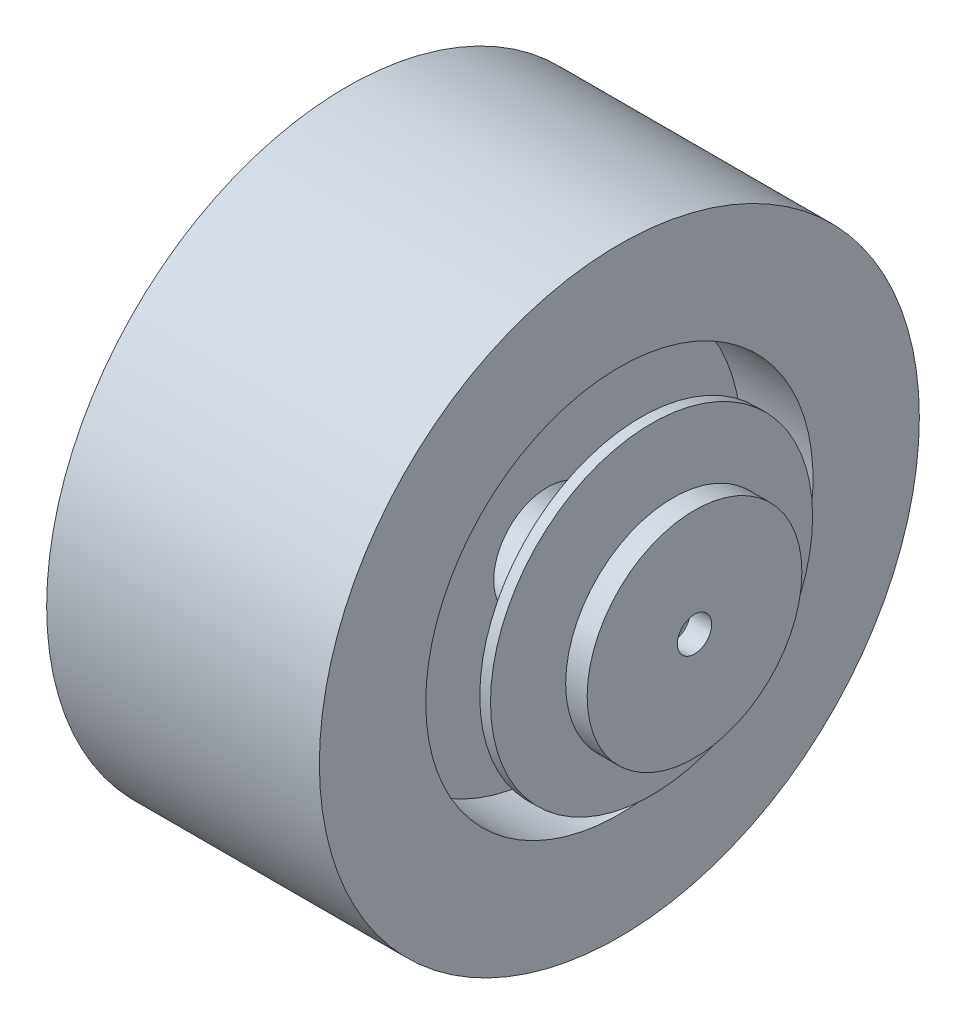
ISO-10303-21;
HEADER;
FILE_DESCRIPTION(('STEP AP214'),'2;1');
FILE_NAME('part.step','',(''),(''),'','','');
FILE_SCHEMA(('AUTOMOTIVE_DESIGN { 1 0 10303 214 1 1 1 1 }'));
ENDSEC;
DATA;
#1=APPLICATION_CONTEXT('core data for automotive mechanical design processes');
#2=APPLICATION_PROTOCOL_DEFINITION('international standard','automotive_design',2000,#1);
#3=PRODUCT_CONTEXT('',#1,'mechanical');
#4=PRODUCT('Part','Part','',(#3));
#5=PRODUCT_RELATED_PRODUCT_CATEGORY('part','',(#4));
#6=PRODUCT_DEFINITION_FORMATION('','',#4);
#7=PRODUCT_DEFINITION_CONTEXT('part definition',#1,'design');
#8=PRODUCT_DEFINITION('design','',#6,#7);
#9=PRODUCT_DEFINITION_SHAPE('','',#8);
#10=(LENGTH_UNIT() NAMED_UNIT(*) SI_UNIT(.MILLI.,.METRE.));
#11=(NAMED_UNIT(*) PLANE_ANGLE_UNIT() SI_UNIT($,.RADIAN.));
#12=(NAMED_UNIT(*) SI_UNIT($,.STERADIAN.) SOLID_ANGLE_UNIT());
#13=UNCERTAINTY_MEASURE_WITH_UNIT(LENGTH_MEASURE(1.E-05),#10,'distance_accuracy_value','');
#14=(GEOMETRIC_REPRESENTATION_CONTEXT(3) GLOBAL_UNCERTAINTY_ASSIGNED_CONTEXT((#13)) GLOBAL_UNIT_ASSIGNED_CONTEXT((#10,
#11,#12)) REPRESENTATION_CONTEXT('',''));
#15=CARTESIAN_POINT('',(0.,0.,0.));
#16=DIRECTION('',(0.,0.,1.));
#17=DIRECTION('',(1.,0.,0.));
#18=AXIS2_PLACEMENT_3D('',#15,#16,#17);
#19=CARTESIAN_POINT('',(98.5,0.,0.));
#20=DIRECTION('',(-1.,0.,0.));
#21=DIRECTION('',(0.,0.,1.));
#22=AXIS2_PLACEMENT_3D('',#19,#20,#21);
#23=CYLINDRICAL_SURFACE('',#22,50.);
#24=CARTESIAN_POINT('',(98.5,0.,0.));
#25=DIRECTION('',(1.,0.,0.));
#26=DIRECTION('',(0.,0.,-1.));
#27=AXIS2_PLACEMENT_3D('',#24,#25,#26);
#28=CIRCLE('',#27,50.);
#29=CARTESIAN_POINT('',(98.5,0.,-50.));
#30=VERTEX_POINT('',#29);
#31=EDGE_CURVE('E11',#30,#30,#28,.T.);
#32=ORIENTED_EDGE('',*,*,#31,.F.);
#33=EDGE_LOOP('',(#32));
#34=FACE_BOUND('',#33,.T.);
#35=CARTESIAN_POINT('',(88.5,0.,0.));
#36=DIRECTION('',(1.,0.,0.));
#37=DIRECTION('',(0.,0.,-1.));
#38=AXIS2_PLACEMENT_3D('',#35,#36,#37);
#39=CIRCLE('',#38,50.);
#40=CARTESIAN_POINT('',(88.5,0.,-50.));
#41=VERTEX_POINT('',#40);
#42=EDGE_CURVE('E56',#41,#41,#39,.T.);
#43=ORIENTED_EDGE('',*,*,#42,.T.);
#44=EDGE_LOOP('',(#43));
#45=FACE_BOUND('',#44,.T.);
#46=ADVANCED_FACE('F49',(#34,#45),#23,.T.);
#47=CARTESIAN_POINT('',(98.5,0.,0.));
#48=DIRECTION('',(1.,0.,0.));
#49=DIRECTION('',(0.,0.,-1.));
#50=AXIS2_PLACEMENT_3D('',#47,#48,#49);
#51=PLANE('',#50);
#52=CARTESIAN_POINT('',(98.5,0.,0.));
#53=DIRECTION('',(1.,0.,0.));
#54=DIRECTION('',(0.,0.,-1.));
#55=AXIS2_PLACEMENT_3D('',#52,#53,#54);
#56=CIRCLE('',#55,8.);
#57=CARTESIAN_POINT('',(98.5,0.,-8.));
#58=VERTEX_POINT('',#57);
#59=EDGE_CURVE('E62',#58,#58,#56,.T.);
#60=ORIENTED_EDGE('',*,*,#59,.F.);
#61=EDGE_LOOP('',(#60));
#62=FACE_BOUND('',#61,.T.);
#63=ORIENTED_EDGE('',*,*,#31,.T.);
#64=EDGE_LOOP('',(#63));
#65=FACE_BOUND('',#64,.T.);
#66=ADVANCED_FACE('F79',(#62,#65),#51,.T.);
#67=CARTESIAN_POINT('',(88.5,0.,0.));
#68=DIRECTION('',(1.,0.,0.));
#69=DIRECTION('',(0.,0.,-1.));
#70=AXIS2_PLACEMENT_3D('',#67,#68,#69);
#71=PLANE('',#70);
#72=CARTESIAN_POINT('',(88.5,0.,0.));
#73=DIRECTION('',(1.,0.,0.));
#74=DIRECTION('',(0.,0.,-1.));
#75=AXIS2_PLACEMENT_3D('',#72,#73,#74);
#76=CIRCLE('',#75,8.);
#77=CARTESIAN_POINT('',(88.5,0.,-8.));
#78=VERTEX_POINT('',#77);
#79=EDGE_CURVE('E52',#78,#78,#76,.T.);
#80=ORIENTED_EDGE('',*,*,#79,.T.);
#81=EDGE_LOOP('',(#80));
#82=FACE_BOUND('',#81,.T.);
#83=ORIENTED_EDGE('',*,*,#42,.F.);
#84=EDGE_LOOP('',(#83));
#85=FACE_BOUND('',#84,.T.);
#86=ADVANCED_FACE('F69',(#82,#85),#71,.F.);
#87=CARTESIAN_POINT('',(-63.5,0.,0.));
#88=DIRECTION('',(1.,0.,0.));
#89=DIRECTION('',(0.,0.,-1.));
#90=AXIS2_PLACEMENT_3D('',#87,#88,#89);
#91=CYLINDRICAL_SURFACE('',#90,8.);
#92=ORIENTED_EDGE('',*,*,#59,.T.);
#93=EDGE_LOOP('',(#92));
#94=FACE_BOUND('',#93,.T.);
#95=ORIENTED_EDGE('',*,*,#79,.F.);
#96=EDGE_LOOP('',(#95));
#97=FACE_BOUND('',#96,.T.);
#98=ADVANCED_FACE('F72',(#94,#97),#91,.F.);
#99=CLOSED_SHELL('',(#46,#66,#86,#98));
#100=MANIFOLD_SOLID_BREP('B2',#99);
#101=CARTESIAN_POINT('',(78.5,0.,0.));
#102=DIRECTION('',(-1.,0.,0.));
#103=DIRECTION('',(0.,0.,1.));
#104=AXIS2_PLACEMENT_3D('',#101,#102,#103);
#105=CYLINDRICAL_SURFACE('',#104,75.);
#106=CARTESIAN_POINT('',(78.5,0.,0.));
#107=DIRECTION('',(1.,0.,0.));
#108=DIRECTION('',(0.,0.,-1.));
#109=AXIS2_PLACEMENT_3D('',#106,#107,#108);
#110=CIRCLE('',#109,75.);
#111=CARTESIAN_POINT('',(78.5,0.,-75.));
#112=VERTEX_POINT('',#111);
#113=EDGE_CURVE('E48',#112,#112,#110,.T.);
#114=ORIENTED_EDGE('',*,*,#113,.F.);
#115=EDGE_LOOP('',(#114));
#116=FACE_BOUND('',#115,.T.);
#117=CARTESIAN_POINT('',(73.5,0.,0.));
#118=DIRECTION('',(1.,0.,0.));
#119=DIRECTION('',(0.,0.,-1.));
#120=AXIS2_PLACEMENT_3D('',#117,#118,#119);
#121=CIRCLE('',#120,75.);
#122=CARTESIAN_POINT('',(73.5,0.,-75.));
#123=VERTEX_POINT('',#122);
#124=EDGE_CURVE('E132',#123,#123,#121,.T.);
#125=ORIENTED_EDGE('',*,*,#124,.T.);
#126=EDGE_LOOP('',(#125));
#127=FACE_BOUND('',#126,.T.);
#128=ADVANCED_FACE('F125',(#116,#127),#105,.T.);
#129=CARTESIAN_POINT('',(78.5,0.,0.));
#130=DIRECTION('',(1.,0.,0.));
#131=DIRECTION('',(0.,0.,-1.));
#132=AXIS2_PLACEMENT_3D('',#129,#130,#131);
#133=PLANE('',#132);
#134=CARTESIAN_POINT('',(78.5,0.,0.));
#135=DIRECTION('',(1.,0.,0.));
#136=DIRECTION('',(0.,0.,-1.));
#137=AXIS2_PLACEMENT_3D('',#134,#135,#136);
#138=CIRCLE('',#137,8.);
#139=CARTESIAN_POINT('',(78.5,0.,-8.));
#140=VERTEX_POINT('',#139);
#141=EDGE_CURVE('E137',#140,#140,#138,.T.);
#142=ORIENTED_EDGE('',*,*,#141,.F.);
#143=EDGE_LOOP('',(#142));
#144=FACE_BOUND('',#143,.T.);
#145=ORIENTED_EDGE('',*,*,#113,.T.);
#146=EDGE_LOOP('',(#145));
#147=FACE_BOUND('',#146,.T.);
#148=ADVANCED_FACE('F155',(#144,#147),#133,.T.);
#149=CARTESIAN_POINT('',(73.5,0.,0.));
#150=DIRECTION('',(1.,0.,0.));
#151=DIRECTION('',(0.,0.,-1.));
#152=AXIS2_PLACEMENT_3D('',#149,#150,#151);
#153=PLANE('',#152);
#154=CARTESIAN_POINT('',(73.5,0.,0.));
#155=DIRECTION('',(1.,0.,0.));
#156=DIRECTION('',(0.,0.,-1.));
#157=AXIS2_PLACEMENT_3D('',#154,#155,#156);
#158=CIRCLE('',#157,8.);
#159=CARTESIAN_POINT('',(73.5,0.,-8.));
#160=VERTEX_POINT('',#159);
#161=EDGE_CURVE('E128',#160,#160,#158,.T.);
#162=ORIENTED_EDGE('',*,*,#161,.T.);
#163=EDGE_LOOP('',(#162));
#164=FACE_BOUND('',#163,.T.);
#165=ORIENTED_EDGE('',*,*,#124,.F.);
#166=EDGE_LOOP('',(#165));
#167=FACE_BOUND('',#166,.T.);
#168=ADVANCED_FACE('F145',(#164,#167),#153,.F.);
#169=CARTESIAN_POINT('',(-63.5,0.,0.));
#170=DIRECTION('',(1.,0.,0.));
#171=DIRECTION('',(0.,0.,-1.));
#172=AXIS2_PLACEMENT_3D('',#169,#170,#171);
#173=CYLINDRICAL_SURFACE('',#172,8.);
#174=ORIENTED_EDGE('',*,*,#141,.T.);
#175=EDGE_LOOP('',(#174));
#176=FACE_BOUND('',#175,.T.);
#177=ORIENTED_EDGE('',*,*,#161,.F.);
#178=EDGE_LOOP('',(#177));
#179=FACE_BOUND('',#178,.T.);
#180=ADVANCED_FACE('F148',(#176,#179),#173,.F.);
#181=CLOSED_SHELL('',(#128,#148,#168,#180));
#182=MANIFOLD_SOLID_BREP('B6',#181);
#183=CARTESIAN_POINT('',(-62.8571428571427,0.,0.));
#184=DIRECTION('',(-1.,0.,0.));
#185=DIRECTION('',(0.,0.,1.));
#186=AXIS2_PLACEMENT_3D('',#183,#184,#185);
#187=CYLINDRICAL_SURFACE('',#186,139.7);
#188=CARTESIAN_POINT('',(-63.5,0.,0.));
#189=DIRECTION('',(-1.,0.,0.));
#190=DIRECTION('',(0.,0.,1.));
#191=AXIS2_PLACEMENT_3D('',#188,#189,#190);
#192=CIRCLE('',#191,139.7);
#193=CARTESIAN_POINT('',(-63.5,0.,139.7));
#194=VERTEX_POINT('',#193);
#195=EDGE_CURVE('E124',#194,#194,#192,.T.);
#196=ORIENTED_EDGE('',*,*,#195,.F.);
#197=EDGE_LOOP('',(#196));
#198=FACE_BOUND('',#197,.T.);
#199=CARTESIAN_POINT('',(63.5,0.,0.));
#200=DIRECTION('',(-1.,0.,0.));
#201=DIRECTION('',(0.,0.,1.));
#202=AXIS2_PLACEMENT_3D('',#199,#200,#201);
#203=CIRCLE('',#202,139.7);
#204=CARTESIAN_POINT('',(63.5,0.,139.7));
#205=VERTEX_POINT('',#204);
#206=EDGE_CURVE('E217',#205,#205,#203,.T.);
#207=ORIENTED_EDGE('',*,*,#206,.T.);
#208=EDGE_LOOP('',(#207));
#209=FACE_BOUND('',#208,.T.);
#210=ADVANCED_FACE('F194',(#198,#209),#187,.T.);
#211=CARTESIAN_POINT('',(-63.5,-139.7,0.));
#212=DIRECTION('',(-1.,0.,0.));
#213=DIRECTION('',(0.,0.,1.));
#214=AXIS2_PLACEMENT_3D('',#211,#212,#213);
#215=PLANE('',#214);
#216=ORIENTED_EDGE('',*,*,#195,.T.);
#217=EDGE_LOOP('',(#216));
#218=FACE_BOUND('',#217,.T.);
#219=CARTESIAN_POINT('',(-63.5,0.,0.));
#220=DIRECTION('',(-1.,0.,0.));
#221=DIRECTION('',(0.,0.,1.));
#222=AXIS2_PLACEMENT_3D('',#219,#220,#221);
#223=CIRCLE('',#222,90.17);
#224=CARTESIAN_POINT('',(-63.5,0.,90.17));
#225=VERTEX_POINT('',#224);
#226=EDGE_CURVE('E201',#225,#225,#223,.T.);
#227=ORIENTED_EDGE('',*,*,#226,.F.);
#228=EDGE_LOOP('',(#227));
#229=FACE_BOUND('',#228,.T.);
#230=ADVANCED_FACE('F253',(#218,#229),#215,.T.);
#231=CARTESIAN_POINT('',(-62.8571428571427,0.,0.));
#232=DIRECTION('',(-1.,0.,0.));
#233=DIRECTION('',(0.,0.,1.));
#234=AXIS2_PLACEMENT_3D('',#231,#232,#233);
#235=CYLINDRICAL_SURFACE('',#234,90.17);
#236=ORIENTED_EDGE('',*,*,#226,.T.);
#237=EDGE_LOOP('',(#236));
#238=FACE_BOUND('',#237,.T.);
#239=CARTESIAN_POINT('',(-30.,0.,0.));
#240=DIRECTION('',(-1.,0.,0.));
#241=DIRECTION('',(0.,0.,1.));
#242=AXIS2_PLACEMENT_3D('',#239,#240,#241);
#243=CIRCLE('',#242,90.17);
#244=CARTESIAN_POINT('',(-30.,0.,90.17));
#245=VERTEX_POINT('',#244);
#246=EDGE_CURVE('E206',#245,#245,#243,.T.);
#247=ORIENTED_EDGE('',*,*,#246,.F.);
#248=EDGE_LOOP('',(#247));
#249=FACE_BOUND('',#248,.T.);
#250=ADVANCED_FACE('F249',(#238,#249),#235,.F.);
#251=CARTESIAN_POINT('',(-30.,-90.17,0.));
#252=DIRECTION('',(-1.,0.,0.));
#253=DIRECTION('',(0.,0.,1.));
#254=AXIS2_PLACEMENT_3D('',#251,#252,#253);
#255=PLANE('',#254);
#256=ORIENTED_EDGE('',*,*,#246,.T.);
#257=EDGE_LOOP('',(#256));
#258=FACE_BOUND('',#257,.T.);
#259=CARTESIAN_POINT('',(-30.,0.,0.));
#260=DIRECTION('',(-1.,0.,0.));
#261=DIRECTION('',(0.,0.,1.));
#262=AXIS2_PLACEMENT_3D('',#259,#260,#261);
#263=CIRCLE('',#262,25.);
#264=CARTESIAN_POINT('',(-30.,0.,25.));
#265=VERTEX_POINT('',#264);
#266=EDGE_CURVE('E211',#265,#265,#263,.T.);
#267=ORIENTED_EDGE('',*,*,#266,.F.);
#268=EDGE_LOOP('',(#267));
#269=FACE_BOUND('',#268,.T.);
#270=ADVANCED_FACE('F239',(#258,#269),#255,.T.);
#271=CARTESIAN_POINT('',(-62.8571428571427,0.,0.));
#272=DIRECTION('',(-1.,0.,0.));
#273=DIRECTION('',(0.,0.,1.));
#274=AXIS2_PLACEMENT_3D('',#271,#272,#273);
#275=CYLINDRICAL_SURFACE('',#274,25.);
#276=ORIENTED_EDGE('',*,*,#266,.T.);
#277=EDGE_LOOP('',(#276));
#278=FACE_BOUND('',#277,.T.);
#279=CARTESIAN_POINT('',(30.,0.,0.));
#280=DIRECTION('',(-1.,0.,0.));
#281=DIRECTION('',(0.,0.,1.));
#282=AXIS2_PLACEMENT_3D('',#279,#280,#281);
#283=CIRCLE('',#282,25.);
#284=CARTESIAN_POINT('',(30.,0.,25.));
#285=VERTEX_POINT('',#284);
#286=EDGE_CURVE('E229',#285,#285,#283,.T.);
#287=ORIENTED_EDGE('',*,*,#286,.F.);
#288=EDGE_LOOP('',(#287));
#289=FACE_BOUND('',#288,.T.);
#290=ADVANCED_FACE('F236',(#278,#289),#275,.F.);
#291=CARTESIAN_POINT('',(63.5,-139.7,0.));
#292=DIRECTION('',(1.,0.,0.));
#293=DIRECTION('',(0.,0.,1.));
#294=AXIS2_PLACEMENT_3D('',#291,#292,#293);
#295=PLANE('',#294);
#296=ORIENTED_EDGE('',*,*,#206,.F.);
#297=EDGE_LOOP('',(#296));
#298=FACE_BOUND('',#297,.T.);
#299=CARTESIAN_POINT('',(63.5,0.,0.));
#300=DIRECTION('',(-1.,0.,0.));
#301=DIRECTION('',(0.,0.,1.));
#302=AXIS2_PLACEMENT_3D('',#299,#300,#301);
#303=CIRCLE('',#302,90.17);
#304=CARTESIAN_POINT('',(63.5,0.,90.17));
#305=VERTEX_POINT('',#304);
#306=EDGE_CURVE('E221',#305,#305,#303,.T.);
#307=ORIENTED_EDGE('',*,*,#306,.T.);
#308=EDGE_LOOP('',(#307));
#309=FACE_BOUND('',#308,.T.);
#310=ADVANCED_FACE('F238',(#298,#309),#295,.T.);
#311=CARTESIAN_POINT('',(62.8571428571427,0.,0.));
#312=DIRECTION('',(1.,0.,0.));
#313=DIRECTION('',(0.,0.,1.));
#314=AXIS2_PLACEMENT_3D('',#311,#312,#313);
#315=CYLINDRICAL_SURFACE('',#314,90.17);
#316=ORIENTED_EDGE('',*,*,#306,.F.);
#317=EDGE_LOOP('',(#316));
#318=FACE_BOUND('',#317,.T.);
#319=CARTESIAN_POINT('',(30.,0.,0.));
#320=DIRECTION('',(-1.,0.,0.));
#321=DIRECTION('',(0.,0.,1.));
#322=AXIS2_PLACEMENT_3D('',#319,#320,#321);
#323=CIRCLE('',#322,90.17);
#324=CARTESIAN_POINT('',(30.,0.,90.17));
#325=VERTEX_POINT('',#324);
#326=EDGE_CURVE('E225',#325,#325,#323,.T.);
#327=ORIENTED_EDGE('',*,*,#326,.T.);
#328=EDGE_LOOP('',(#327));
#329=FACE_BOUND('',#328,.T.);
#330=ADVANCED_FACE('F246',(#318,#329),#315,.F.);
#331=CARTESIAN_POINT('',(30.,-90.17,0.));
#332=DIRECTION('',(1.,0.,0.));
#333=DIRECTION('',(0.,0.,1.));
#334=AXIS2_PLACEMENT_3D('',#331,#332,#333);
#335=PLANE('',#334);
#336=ORIENTED_EDGE('',*,*,#326,.F.);
#337=EDGE_LOOP('',(#336));
#338=FACE_BOUND('',#337,.T.);
#339=ORIENTED_EDGE('',*,*,#286,.T.);
#340=EDGE_LOOP('',(#339));
#341=FACE_BOUND('',#340,.T.);
#342=ADVANCED_FACE('F234',(#338,#341),#335,.T.);
#343=CLOSED_SHELL('',(#210,#230,#250,#270,#290,#310,#330,#342));
#344=MANIFOLD_SOLID_BREP('B43',#343);
#345=ADVANCED_BREP_SHAPE_REPRESENTATION('',(#18,#100,#182,#344),#14);
#346=SHAPE_DEFINITION_REPRESENTATION(#9,#345);
ENDSEC;
END-ISO-10303-21;
